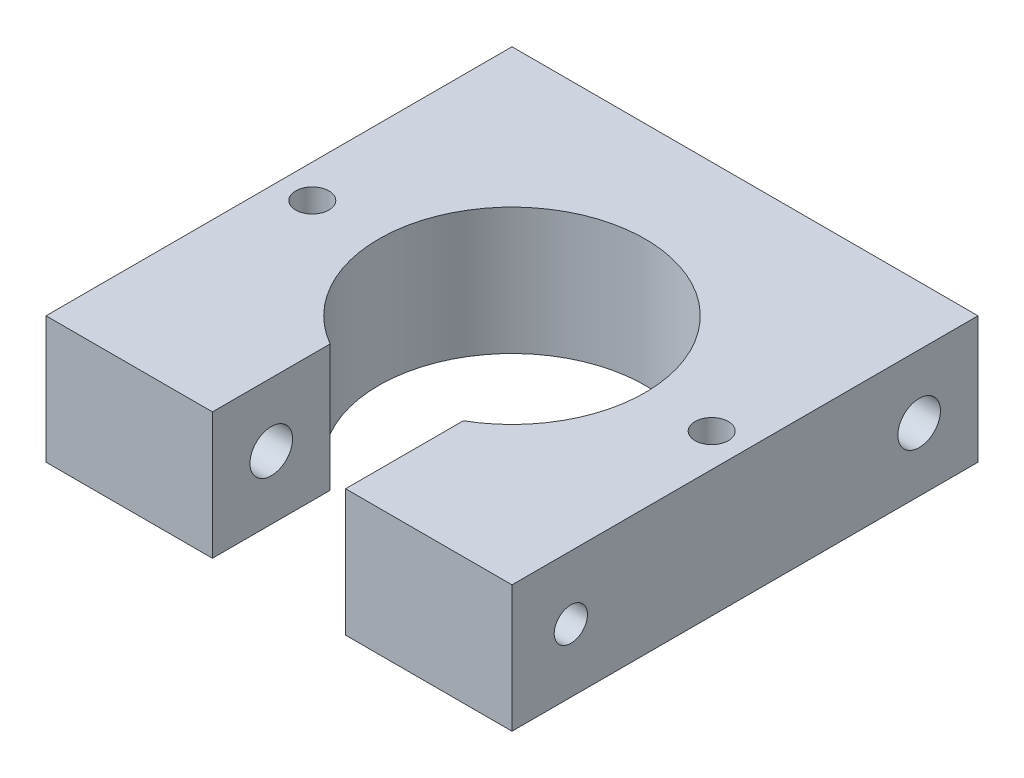
ISO-10303-21;
HEADER;
FILE_DESCRIPTION(('STEP AP214'),'2;1');
FILE_NAME('part.step','',(''),(''),'','','');
FILE_SCHEMA(('AUTOMOTIVE_DESIGN { 1 0 10303 214 1 1 1 1 }'));
ENDSEC;
DATA;
#1=APPLICATION_CONTEXT('core data for automotive mechanical design processes');
#2=APPLICATION_PROTOCOL_DEFINITION('international standard','automotive_design',2000,#1);
#3=PRODUCT_CONTEXT('',#1,'mechanical');
#4=PRODUCT('Part','Part','',(#3));
#5=PRODUCT_RELATED_PRODUCT_CATEGORY('part','',(#4));
#6=PRODUCT_DEFINITION_FORMATION('','',#4);
#7=PRODUCT_DEFINITION_CONTEXT('part definition',#1,'design');
#8=PRODUCT_DEFINITION('design','',#6,#7);
#9=PRODUCT_DEFINITION_SHAPE('','',#8);
#10=(LENGTH_UNIT() NAMED_UNIT(*) SI_UNIT(.MILLI.,.METRE.));
#11=(NAMED_UNIT(*) PLANE_ANGLE_UNIT() SI_UNIT($,.RADIAN.));
#12=(NAMED_UNIT(*) SI_UNIT($,.STERADIAN.) SOLID_ANGLE_UNIT());
#13=UNCERTAINTY_MEASURE_WITH_UNIT(LENGTH_MEASURE(1.E-05),#10,'distance_accuracy_value','');
#14=(GEOMETRIC_REPRESENTATION_CONTEXT(3) GLOBAL_UNCERTAINTY_ASSIGNED_CONTEXT((#13)) GLOBAL_UNIT_ASSIGNED_CONTEXT((#10,
#11,#12)) REPRESENTATION_CONTEXT('',''));
#15=CARTESIAN_POINT('',(0.,0.,0.));
#16=DIRECTION('',(0.,0.,1.));
#17=DIRECTION('',(1.,0.,0.));
#18=AXIS2_PLACEMENT_3D('',#15,#16,#17);
#19=CARTESIAN_POINT('',(-17.5,9.525,17.5));
#20=DIRECTION('',(1.,0.,0.));
#21=DIRECTION('',(0.,0.,-1.));
#22=AXIS2_PLACEMENT_3D('',#19,#20,#21);
#23=PLANE('',#22);
#24=DIRECTION('',(0.,0.,1.));
#25=VECTOR('',#24,1.);
#26=CARTESIAN_POINT('',(-17.5,0.,17.5));
#27=LINE('',#26,#25);
#28=CARTESIAN_POINT('',(-17.5,0.,-17.5));
#29=VERTEX_POINT('',#28);
#30=CARTESIAN_POINT('',(-17.5,0.,17.5));
#31=VERTEX_POINT('',#30);
#32=EDGE_CURVE('E133',#29,#31,#27,.T.);
#33=ORIENTED_EDGE('',*,*,#32,.T.);
#34=DIRECTION('',(0.,-1.,0.));
#35=VECTOR('',#34,1.);
#36=CARTESIAN_POINT('',(-17.5,9.525,17.5));
#37=LINE('',#36,#35);
#38=CARTESIAN_POINT('',(-17.5,9.525,17.5));
#39=VERTEX_POINT('',#38);
#40=EDGE_CURVE('E11',#39,#31,#37,.T.);
#41=ORIENTED_EDGE('',*,*,#40,.F.);
#42=DIRECTION('',(0.,0.,1.));
#43=VECTOR('',#42,1.);
#44=CARTESIAN_POINT('',(-17.5,9.525,17.5));
#45=LINE('',#44,#43);
#46=CARTESIAN_POINT('',(-17.5,9.525,-17.5));
#47=VERTEX_POINT('',#46);
#48=EDGE_CURVE('E150',#47,#39,#45,.T.);
#49=ORIENTED_EDGE('',*,*,#48,.F.);
#50=DIRECTION('',(0.,-1.,0.));
#51=VECTOR('',#50,1.);
#52=CARTESIAN_POINT('',(-17.5,9.525,-17.5));
#53=LINE('',#52,#51);
#54=EDGE_CURVE('E129',#47,#29,#53,.T.);
#55=ORIENTED_EDGE('',*,*,#54,.T.);
#56=EDGE_LOOP('',(#33,#41,#49,#55));
#57=FACE_BOUND('',#56,.T.);
#58=CARTESIAN_POINT('',(-17.5,4.7625,13.08015));
#59=DIRECTION('',(-1.,0.,0.));
#60=DIRECTION('',(0.,0.,1.));
#61=AXIS2_PLACEMENT_3D('',#58,#59,#60);
#62=CIRCLE('',#61,1.6);
#63=CARTESIAN_POINT('',(-17.5,4.7625,14.68015));
#64=VERTEX_POINT('',#63);
#65=EDGE_CURVE('E200',#64,#64,#62,.T.);
#66=ORIENTED_EDGE('',*,*,#65,.F.);
#67=EDGE_LOOP('',(#66));
#68=FACE_BOUND('',#67,.T.);
#69=CARTESIAN_POINT('',(-17.5,4.7625,-13.08015));
#70=DIRECTION('',(-1.,0.,0.));
#71=DIRECTION('',(0.,0.,1.));
#72=AXIS2_PLACEMENT_3D('',#69,#70,#71);
#73=CIRCLE('',#72,1.6);
#74=CARTESIAN_POINT('',(-17.5,4.7625,-11.48015));
#75=VERTEX_POINT('',#74);
#76=EDGE_CURVE('E206',#75,#75,#73,.T.);
#77=ORIENTED_EDGE('',*,*,#76,.F.);
#78=EDGE_LOOP('',(#77));
#79=FACE_BOUND('',#78,.T.);
#80=ADVANCED_FACE('F35',(#57,#68,#79),#23,.F.);
#81=CARTESIAN_POINT('',(17.5,9.525,-17.5));
#82=DIRECTION('',(-1.,0.,0.));
#83=DIRECTION('',(0.,0.,1.));
#84=AXIS2_PLACEMENT_3D('',#81,#82,#83);
#85=PLANE('',#84);
#86=CARTESIAN_POINT('',(17.5,4.7625,-13.08015));
#87=DIRECTION('',(-1.,0.,0.));
#88=DIRECTION('',(0.,0.,1.));
#89=AXIS2_PLACEMENT_3D('',#86,#87,#88);
#90=CIRCLE('',#89,1.59999999999999);
#91=CARTESIAN_POINT('',(17.5,4.7625,-11.48015));
#92=VERTEX_POINT('',#91);
#93=EDGE_CURVE('E203',#92,#92,#90,.T.);
#94=ORIENTED_EDGE('',*,*,#93,.T.);
#95=EDGE_LOOP('',(#94));
#96=FACE_BOUND('',#95,.T.);
#97=DIRECTION('',(0.,0.,-1.));
#98=VECTOR('',#97,1.);
#99=CARTESIAN_POINT('',(17.5,0.,-17.5));
#100=LINE('',#99,#98);
#101=CARTESIAN_POINT('',(17.5,0.,17.5));
#102=VERTEX_POINT('',#101);
#103=CARTESIAN_POINT('',(17.5,0.,-17.5));
#104=VERTEX_POINT('',#103);
#105=EDGE_CURVE('E147',#102,#104,#100,.T.);
#106=ORIENTED_EDGE('',*,*,#105,.T.);
#107=DIRECTION('',(0.,-1.,0.));
#108=VECTOR('',#107,1.);
#109=CARTESIAN_POINT('',(17.5,9.525,-17.5));
#110=LINE('',#109,#108);
#111=CARTESIAN_POINT('',(17.5,9.525,-17.5));
#112=VERTEX_POINT('',#111);
#113=EDGE_CURVE('E124',#112,#104,#110,.T.);
#114=ORIENTED_EDGE('',*,*,#113,.F.);
#115=DIRECTION('',(0.,0.,-1.));
#116=VECTOR('',#115,1.);
#117=CARTESIAN_POINT('',(17.5,9.525,-17.5));
#118=LINE('',#117,#116);
#119=CARTESIAN_POINT('',(17.5,9.525,17.5));
#120=VERTEX_POINT('',#119);
#121=EDGE_CURVE('E109',#120,#112,#118,.T.);
#122=ORIENTED_EDGE('',*,*,#121,.F.);
#123=DIRECTION('',(0.,-1.,0.));
#124=VECTOR('',#123,1.);
#125=CARTESIAN_POINT('',(17.5,9.525,17.5));
#126=LINE('',#125,#124);
#127=EDGE_CURVE('E118',#120,#102,#126,.T.);
#128=ORIENTED_EDGE('',*,*,#127,.T.);
#129=EDGE_LOOP('',(#106,#114,#122,#128));
#130=FACE_BOUND('',#129,.T.);
#131=CARTESIAN_POINT('',(17.5,4.7625,13.08015));
#132=DIRECTION('',(1.,0.,0.));
#133=DIRECTION('',(0.,0.,-1.));
#134=AXIS2_PLACEMENT_3D('',#131,#132,#133);
#135=CIRCLE('',#134,1.24999999999999);
#136=CARTESIAN_POINT('',(17.5,4.7625,11.83015));
#137=VERTEX_POINT('',#136);
#138=EDGE_CURVE('E194',#137,#137,#135,.T.);
#139=ORIENTED_EDGE('',*,*,#138,.F.);
#140=EDGE_LOOP('',(#139));
#141=FACE_BOUND('',#140,.T.);
#142=ADVANCED_FACE('F126',(#96,#130,#141),#85,.F.);
#143=CARTESIAN_POINT('',(-5.,9.525,17.5));
#144=DIRECTION('',(0.,0.,-1.));
#145=DIRECTION('',(-1.,0.,0.));
#146=AXIS2_PLACEMENT_3D('',#143,#144,#145);
#147=PLANE('',#146);
#148=DIRECTION('',(1.,0.,0.));
#149=VECTOR('',#148,1.);
#150=CARTESIAN_POINT('',(-5.,0.,17.5));
#151=LINE('',#150,#149);
#152=CARTESIAN_POINT('',(-5.,0.,17.5));
#153=VERTEX_POINT('',#152);
#154=EDGE_CURVE('E136',#31,#153,#151,.T.);
#155=ORIENTED_EDGE('',*,*,#154,.T.);
#156=DIRECTION('',(0.,-1.,0.));
#157=VECTOR('',#156,1.);
#158=CARTESIAN_POINT('',(-5.,9.525,17.5));
#159=LINE('',#158,#157);
#160=CARTESIAN_POINT('',(-5.,9.525,17.5));
#161=VERTEX_POINT('',#160);
#162=EDGE_CURVE('E43',#161,#153,#159,.T.);
#163=ORIENTED_EDGE('',*,*,#162,.F.);
#164=DIRECTION('',(1.,0.,0.));
#165=VECTOR('',#164,1.);
#166=CARTESIAN_POINT('',(-5.,9.525,17.5));
#167=LINE('',#166,#165);
#168=EDGE_CURVE('E92',#39,#161,#167,.T.);
#169=ORIENTED_EDGE('',*,*,#168,.F.);
#170=ORIENTED_EDGE('',*,*,#40,.T.);
#171=EDGE_LOOP('',(#155,#163,#169,#170));
#172=FACE_BOUND('',#171,.T.);
#173=ADVANCED_FACE('F217',(#172),#147,.F.);
#174=CARTESIAN_POINT('',(-5.00000000000001,9.525,8.66025403784439));
#175=DIRECTION('',(-1.,0.,0.));
#176=DIRECTION('',(0.,0.,1.));
#177=AXIS2_PLACEMENT_3D('',#174,#175,#176);
#178=PLANE('',#177);
#179=CARTESIAN_POINT('',(-5.,4.7625,13.08015));
#180=DIRECTION('',(-1.,0.,0.));
#181=DIRECTION('',(0.,0.,1.));
#182=AXIS2_PLACEMENT_3D('',#179,#180,#181);
#183=CIRCLE('',#182,1.59999999999999);
#184=CARTESIAN_POINT('',(-5.,4.7625,14.68015));
#185=VERTEX_POINT('',#184);
#186=EDGE_CURVE('E197',#185,#185,#183,.T.);
#187=ORIENTED_EDGE('',*,*,#186,.T.);
#188=EDGE_LOOP('',(#187));
#189=FACE_BOUND('',#188,.T.);
#190=DIRECTION('',(0.,0.,-1.));
#191=VECTOR('',#190,1.);
#192=CARTESIAN_POINT('',(-5.00000000000001,0.,8.66025403784439));
#193=LINE('',#192,#191);
#194=CARTESIAN_POINT('',(-5.,0.,8.66025403784439));
#195=VERTEX_POINT('',#194);
#196=EDGE_CURVE('E139',#153,#195,#193,.T.);
#197=ORIENTED_EDGE('',*,*,#196,.T.);
#198=DIRECTION('',(0.,-1.,0.));
#199=VECTOR('',#198,1.);
#200=CARTESIAN_POINT('',(-5.,9.525,8.66025403784439));
#201=LINE('',#200,#199);
#202=CARTESIAN_POINT('',(-5.,9.525,8.66025403784439));
#203=VERTEX_POINT('',#202);
#204=EDGE_CURVE('E157',#203,#195,#201,.T.);
#205=ORIENTED_EDGE('',*,*,#204,.F.);
#206=DIRECTION('',(0.,0.,-1.));
#207=VECTOR('',#206,1.);
#208=CARTESIAN_POINT('',(-5.00000000000001,9.525,8.66025403784439));
#209=LINE('',#208,#207);
#210=EDGE_CURVE('E165',#161,#203,#209,.T.);
#211=ORIENTED_EDGE('',*,*,#210,.F.);
#212=ORIENTED_EDGE('',*,*,#162,.T.);
#213=EDGE_LOOP('',(#197,#205,#211,#212));
#214=FACE_BOUND('',#213,.T.);
#215=ADVANCED_FACE('F163',(#189,#214),#178,.F.);
#216=CARTESIAN_POINT('',(0.,9.525,0.));
#217=DIRECTION('',(0.,-1.,0.));
#218=DIRECTION('',(0.,0.,-1.));
#219=AXIS2_PLACEMENT_3D('',#216,#217,#218);
#220=CYLINDRICAL_SURFACE('',#219,10.);
#221=CARTESIAN_POINT('',(0.,0.,0.));
#222=DIRECTION('',(0.,-1.,0.));
#223=DIRECTION('',(0.,0.,-1.));
#224=AXIS2_PLACEMENT_3D('',#221,#222,#223);
#225=CIRCLE('',#224,10.);
#226=CARTESIAN_POINT('',(5.,0.,8.66025403784439));
#227=VERTEX_POINT('',#226);
#228=EDGE_CURVE('E142',#195,#227,#225,.T.);
#229=ORIENTED_EDGE('',*,*,#228,.T.);
#230=DIRECTION('',(0.,-1.,0.));
#231=VECTOR('',#230,1.);
#232=CARTESIAN_POINT('',(5.,9.525,8.66025403784439));
#233=LINE('',#232,#231);
#234=CARTESIAN_POINT('',(5.,9.525,8.66025403784439));
#235=VERTEX_POINT('',#234);
#236=EDGE_CURVE('E154',#235,#227,#233,.T.);
#237=ORIENTED_EDGE('',*,*,#236,.F.);
#238=CARTESIAN_POINT('',(0.,9.525,0.));
#239=DIRECTION('',(0.,-1.,0.));
#240=DIRECTION('',(0.,0.,-1.));
#241=AXIS2_PLACEMENT_3D('',#238,#239,#240);
#242=CIRCLE('',#241,10.);
#243=EDGE_CURVE('E174',#203,#235,#242,.T.);
#244=ORIENTED_EDGE('',*,*,#243,.F.);
#245=ORIENTED_EDGE('',*,*,#204,.T.);
#246=EDGE_LOOP('',(#229,#237,#244,#245));
#247=FACE_BOUND('',#246,.T.);
#248=ADVANCED_FACE('F170',(#247),#220,.F.);
#249=CARTESIAN_POINT('',(5.,9.525,8.66025403784439));
#250=DIRECTION('',(1.,0.,0.));
#251=DIRECTION('',(0.,0.,-1.));
#252=AXIS2_PLACEMENT_3D('',#249,#250,#251);
#253=PLANE('',#252);
#254=CARTESIAN_POINT('',(5.,4.7625,13.08015));
#255=DIRECTION('',(1.,0.,0.));
#256=DIRECTION('',(0.,0.,-1.));
#257=AXIS2_PLACEMENT_3D('',#254,#255,#256);
#258=CIRCLE('',#257,1.24999999999999);
#259=CARTESIAN_POINT('',(5.,4.7625,11.83015));
#260=VERTEX_POINT('',#259);
#261=EDGE_CURVE('E191',#260,#260,#258,.T.);
#262=ORIENTED_EDGE('',*,*,#261,.T.);
#263=EDGE_LOOP('',(#262));
#264=FACE_BOUND('',#263,.T.);
#265=DIRECTION('',(0.,0.,1.));
#266=VECTOR('',#265,1.);
#267=CARTESIAN_POINT('',(5.,0.,8.66025403784439));
#268=LINE('',#267,#266);
#269=CARTESIAN_POINT('',(5.,0.,17.5));
#270=VERTEX_POINT('',#269);
#271=EDGE_CURVE('E144',#227,#270,#268,.T.);
#272=ORIENTED_EDGE('',*,*,#271,.T.);
#273=DIRECTION('',(0.,-1.,0.));
#274=VECTOR('',#273,1.);
#275=CARTESIAN_POINT('',(5.,9.525,17.5));
#276=LINE('',#275,#274);
#277=CARTESIAN_POINT('',(5.,9.525,17.5));
#278=VERTEX_POINT('',#277);
#279=EDGE_CURVE('E123',#278,#270,#276,.T.);
#280=ORIENTED_EDGE('',*,*,#279,.F.);
#281=DIRECTION('',(0.,0.,1.));
#282=VECTOR('',#281,1.);
#283=CARTESIAN_POINT('',(5.,9.525,8.66025403784439));
#284=LINE('',#283,#282);
#285=EDGE_CURVE('E112',#235,#278,#284,.T.);
#286=ORIENTED_EDGE('',*,*,#285,.F.);
#287=ORIENTED_EDGE('',*,*,#236,.T.);
#288=EDGE_LOOP('',(#272,#280,#286,#287));
#289=FACE_BOUND('',#288,.T.);
#290=ADVANCED_FACE('F173',(#264,#289),#253,.F.);
#291=CARTESIAN_POINT('',(17.5,9.525,17.5));
#292=DIRECTION('',(0.,0.,-1.));
#293=DIRECTION('',(-1.,0.,0.));
#294=AXIS2_PLACEMENT_3D('',#291,#292,#293);
#295=PLANE('',#294);
#296=DIRECTION('',(1.,0.,0.));
#297=VECTOR('',#296,1.);
#298=CARTESIAN_POINT('',(17.5,0.,17.5));
#299=LINE('',#298,#297);
#300=EDGE_CURVE('E121',#270,#102,#299,.T.);
#301=ORIENTED_EDGE('',*,*,#300,.T.);
#302=ORIENTED_EDGE('',*,*,#127,.F.);
#303=DIRECTION('',(1.,0.,0.));
#304=VECTOR('',#303,1.);
#305=CARTESIAN_POINT('',(17.5,9.525,17.5));
#306=LINE('',#305,#304);
#307=EDGE_CURVE('E105',#278,#120,#306,.T.);
#308=ORIENTED_EDGE('',*,*,#307,.F.);
#309=ORIENTED_EDGE('',*,*,#279,.T.);
#310=EDGE_LOOP('',(#301,#302,#308,#309));
#311=FACE_BOUND('',#310,.T.);
#312=ADVANCED_FACE('F119',(#311),#295,.F.);
#313=CARTESIAN_POINT('',(-17.5,9.525,-17.5));
#314=DIRECTION('',(0.,0.,1.));
#315=DIRECTION('',(1.,0.,0.));
#316=AXIS2_PLACEMENT_3D('',#313,#314,#315);
#317=PLANE('',#316);
#318=DIRECTION('',(-1.,0.,0.));
#319=VECTOR('',#318,1.);
#320=CARTESIAN_POINT('',(-17.5,0.,-17.5));
#321=LINE('',#320,#319);
#322=EDGE_CURVE('E80',#104,#29,#321,.T.);
#323=ORIENTED_EDGE('',*,*,#322,.T.);
#324=ORIENTED_EDGE('',*,*,#54,.F.);
#325=DIRECTION('',(-1.,0.,0.));
#326=VECTOR('',#325,1.);
#327=CARTESIAN_POINT('',(5.,9.525,-17.5));
#328=LINE('',#327,#326);
#329=EDGE_CURVE('E51',#112,#47,#328,.T.);
#330=ORIENTED_EDGE('',*,*,#329,.F.);
#331=ORIENTED_EDGE('',*,*,#113,.T.);
#332=EDGE_LOOP('',(#323,#324,#330,#331));
#333=FACE_BOUND('',#332,.T.);
#334=ADVANCED_FACE('F249',(#333),#317,.F.);
#335=CARTESIAN_POINT('',(0.,9.525,0.));
#336=DIRECTION('',(0.,-1.,0.));
#337=DIRECTION('',(0.,0.,-1.));
#338=AXIS2_PLACEMENT_3D('',#335,#336,#337);
#339=PLANE('',#338);
#340=CARTESIAN_POINT('',(15.,9.525,0.));
#341=DIRECTION('',(0.,1.,0.));
#342=DIRECTION('',(0.,0.,1.));
#343=AXIS2_PLACEMENT_3D('',#340,#341,#342);
#344=CIRCLE('',#343,1.24999999999999);
#345=CARTESIAN_POINT('',(15.,9.525,1.24999999999998));
#346=VERTEX_POINT('',#345);
#347=EDGE_CURVE('E188',#346,#346,#344,.T.);
#348=ORIENTED_EDGE('',*,*,#347,.F.);
#349=EDGE_LOOP('',(#348));
#350=FACE_BOUND('',#349,.T.);
#351=CARTESIAN_POINT('',(-15.,9.525,0.));
#352=DIRECTION('',(0.,1.,0.));
#353=DIRECTION('',(0.,0.,1.));
#354=AXIS2_PLACEMENT_3D('',#351,#352,#353);
#355=CIRCLE('',#354,1.24999999999999);
#356=CARTESIAN_POINT('',(-15.,9.525,1.24999999999999));
#357=VERTEX_POINT('',#356);
#358=EDGE_CURVE('E182',#357,#357,#355,.T.);
#359=ORIENTED_EDGE('',*,*,#358,.F.);
#360=EDGE_LOOP('',(#359));
#361=FACE_BOUND('',#360,.T.);
#362=ORIENTED_EDGE('',*,*,#48,.T.);
#363=ORIENTED_EDGE('',*,*,#168,.T.);
#364=ORIENTED_EDGE('',*,*,#210,.T.);
#365=ORIENTED_EDGE('',*,*,#243,.T.);
#366=ORIENTED_EDGE('',*,*,#285,.T.);
#367=ORIENTED_EDGE('',*,*,#307,.T.);
#368=ORIENTED_EDGE('',*,*,#121,.T.);
#369=ORIENTED_EDGE('',*,*,#329,.T.);
#370=EDGE_LOOP('',(#362,#363,#364,#365,#366,#367,#368,#369));
#371=FACE_BOUND('',#370,.T.);
#372=ADVANCED_FACE('F107',(#350,#361,#371),#339,.F.);
#373=CARTESIAN_POINT('',(0.,0.,0.));
#374=DIRECTION('',(0.,-1.,0.));
#375=DIRECTION('',(0.,0.,-1.));
#376=AXIS2_PLACEMENT_3D('',#373,#374,#375);
#377=PLANE('',#376);
#378=CARTESIAN_POINT('',(15.,0.,0.));
#379=DIRECTION('',(0.,1.,0.));
#380=DIRECTION('',(0.,0.,1.));
#381=AXIS2_PLACEMENT_3D('',#378,#379,#380);
#382=CIRCLE('',#381,1.24999999999999);
#383=CARTESIAN_POINT('',(15.,0.,1.24999999999998));
#384=VERTEX_POINT('',#383);
#385=EDGE_CURVE('E185',#384,#384,#382,.T.);
#386=ORIENTED_EDGE('',*,*,#385,.T.);
#387=EDGE_LOOP('',(#386));
#388=FACE_BOUND('',#387,.T.);
#389=CARTESIAN_POINT('',(-15.,0.,0.));
#390=DIRECTION('',(0.,1.,0.));
#391=DIRECTION('',(0.,0.,1.));
#392=AXIS2_PLACEMENT_3D('',#389,#390,#391);
#393=CIRCLE('',#392,1.24999999999999);
#394=CARTESIAN_POINT('',(-15.,0.,1.24999999999999));
#395=VERTEX_POINT('',#394);
#396=EDGE_CURVE('E137',#395,#395,#393,.T.);
#397=ORIENTED_EDGE('',*,*,#396,.T.);
#398=EDGE_LOOP('',(#397));
#399=FACE_BOUND('',#398,.T.);
#400=ORIENTED_EDGE('',*,*,#32,.F.);
#401=ORIENTED_EDGE('',*,*,#322,.F.);
#402=ORIENTED_EDGE('',*,*,#105,.F.);
#403=ORIENTED_EDGE('',*,*,#300,.F.);
#404=ORIENTED_EDGE('',*,*,#271,.F.);
#405=ORIENTED_EDGE('',*,*,#228,.F.);
#406=ORIENTED_EDGE('',*,*,#196,.F.);
#407=ORIENTED_EDGE('',*,*,#154,.F.);
#408=EDGE_LOOP('',(#400,#401,#402,#403,#404,#405,#406,#407));
#409=FACE_BOUND('',#408,.T.);
#410=ADVANCED_FACE('F166',(#388,#399,#409),#377,.T.);
#411=CARTESIAN_POINT('',(-15.,9.525,0.));
#412=DIRECTION('',(0.,1.,0.));
#413=DIRECTION('',(0.,0.,1.));
#414=AXIS2_PLACEMENT_3D('',#411,#412,#413);
#415=CYLINDRICAL_SURFACE('',#414,1.24999999999999);
#416=ORIENTED_EDGE('',*,*,#396,.F.);
#417=EDGE_LOOP('',(#416));
#418=FACE_BOUND('',#417,.T.);
#419=ORIENTED_EDGE('',*,*,#358,.T.);
#420=EDGE_LOOP('',(#419));
#421=FACE_BOUND('',#420,.T.);
#422=ADVANCED_FACE('F242',(#418,#421),#415,.F.);
#423=CARTESIAN_POINT('',(15.,9.525,0.));
#424=DIRECTION('',(0.,1.,0.));
#425=DIRECTION('',(0.,0.,1.));
#426=AXIS2_PLACEMENT_3D('',#423,#424,#425);
#427=CYLINDRICAL_SURFACE('',#426,1.24999999999999);
#428=ORIENTED_EDGE('',*,*,#385,.F.);
#429=EDGE_LOOP('',(#428));
#430=FACE_BOUND('',#429,.T.);
#431=ORIENTED_EDGE('',*,*,#347,.T.);
#432=EDGE_LOOP('',(#431));
#433=FACE_BOUND('',#432,.T.);
#434=ADVANCED_FACE('F235',(#430,#433),#427,.F.);
#435=CARTESIAN_POINT('',(17.5,4.7625,13.08015));
#436=DIRECTION('',(1.,0.,0.));
#437=DIRECTION('',(0.,0.,-1.));
#438=AXIS2_PLACEMENT_3D('',#435,#436,#437);
#439=CYLINDRICAL_SURFACE('',#438,1.24999999999999);
#440=ORIENTED_EDGE('',*,*,#261,.F.);
#441=EDGE_LOOP('',(#440));
#442=FACE_BOUND('',#441,.T.);
#443=ORIENTED_EDGE('',*,*,#138,.T.);
#444=EDGE_LOOP('',(#443));
#445=FACE_BOUND('',#444,.T.);
#446=ADVANCED_FACE('F226',(#442,#445),#439,.F.);
#447=CARTESIAN_POINT('',(-17.5,4.7625,13.08015));
#448=DIRECTION('',(-1.,0.,0.));
#449=DIRECTION('',(0.,0.,1.));
#450=AXIS2_PLACEMENT_3D('',#447,#448,#449);
#451=CYLINDRICAL_SURFACE('',#450,1.59999999999999);
#452=ORIENTED_EDGE('',*,*,#186,.F.);
#453=EDGE_LOOP('',(#452));
#454=FACE_BOUND('',#453,.T.);
#455=ORIENTED_EDGE('',*,*,#65,.T.);
#456=EDGE_LOOP('',(#455));
#457=FACE_BOUND('',#456,.T.);
#458=ADVANCED_FACE('F224',(#454,#457),#451,.F.);
#459=CARTESIAN_POINT('',(-17.5,4.7625,-13.08015));
#460=DIRECTION('',(-1.,0.,0.));
#461=DIRECTION('',(0.,0.,1.));
#462=AXIS2_PLACEMENT_3D('',#459,#460,#461);
#463=CYLINDRICAL_SURFACE('',#462,1.6);
#464=ORIENTED_EDGE('',*,*,#93,.F.);
#465=EDGE_LOOP('',(#464));
#466=FACE_BOUND('',#465,.T.);
#467=ORIENTED_EDGE('',*,*,#76,.T.);
#468=EDGE_LOOP('',(#467));
#469=FACE_BOUND('',#468,.T.);
#470=ADVANCED_FACE('F210',(#466,#469),#463,.F.);
#471=CLOSED_SHELL('',(#80,#142,#173,#215,#248,#290,#312,#334,#372,#410,#422,#434,#446,#458,#470));
#472=MANIFOLD_SOLID_BREP('B2',#471);
#473=ADVANCED_BREP_SHAPE_REPRESENTATION('',(#18,#472),#14);
#474=SHAPE_DEFINITION_REPRESENTATION(#9,#473);
ENDSEC;
END-ISO-10303-21;
